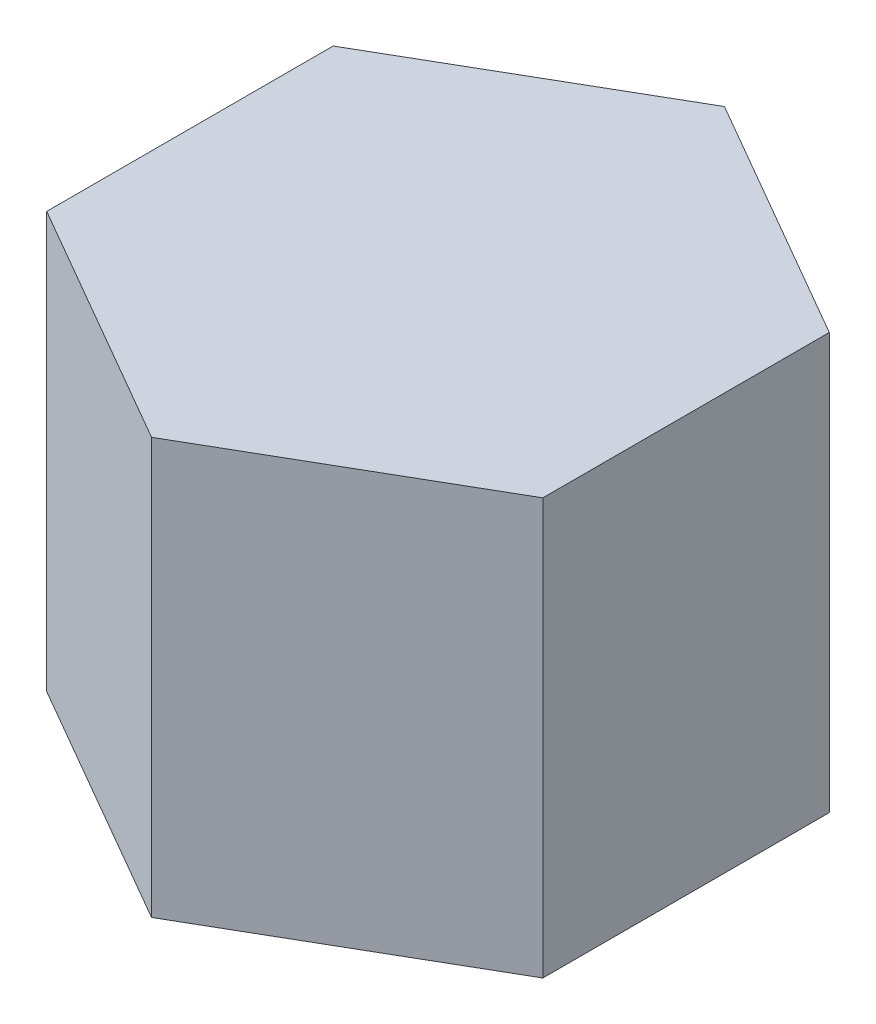
ISO-10303-21;
HEADER;
FILE_DESCRIPTION(('STEP AP214'),'2;1');
FILE_NAME('part.step','',(''),(''),'','','');
FILE_SCHEMA(('AUTOMOTIVE_DESIGN { 1 0 10303 214 1 1 1 1 }'));
ENDSEC;
DATA;
#1=APPLICATION_CONTEXT('core data for automotive mechanical design processes');
#2=APPLICATION_PROTOCOL_DEFINITION('international standard','automotive_design',2000,#1);
#3=PRODUCT_CONTEXT('',#1,'mechanical');
#4=PRODUCT('Part','Part','',(#3));
#5=PRODUCT_RELATED_PRODUCT_CATEGORY('part','',(#4));
#6=PRODUCT_DEFINITION_FORMATION('','',#4);
#7=PRODUCT_DEFINITION_CONTEXT('part definition',#1,'design');
#8=PRODUCT_DEFINITION('design','',#6,#7);
#9=PRODUCT_DEFINITION_SHAPE('','',#8);
#10=(LENGTH_UNIT() NAMED_UNIT(*) SI_UNIT(.MILLI.,.METRE.));
#11=(NAMED_UNIT(*) PLANE_ANGLE_UNIT() SI_UNIT($,.RADIAN.));
#12=(NAMED_UNIT(*) SI_UNIT($,.STERADIAN.) SOLID_ANGLE_UNIT());
#13=UNCERTAINTY_MEASURE_WITH_UNIT(LENGTH_MEASURE(1.E-05),#10,'distance_accuracy_value','');
#14=(GEOMETRIC_REPRESENTATION_CONTEXT(3) GLOBAL_UNCERTAINTY_ASSIGNED_CONTEXT((#13)) GLOBAL_UNIT_ASSIGNED_CONTEXT((#10,
#11,#12)) REPRESENTATION_CONTEXT('',''));
#15=CARTESIAN_POINT('',(0.,0.,0.));
#16=DIRECTION('',(0.,0.,1.));
#17=DIRECTION('',(1.,0.,0.));
#18=AXIS2_PLACEMENT_3D('',#15,#16,#17);
#19=CARTESIAN_POINT('',(208.142660308706,-148.537700895744,288.908895009141));
#20=DIRECTION('',(-0.499999999999943,0.,-0.866025403784472));
#21=DIRECTION('',(-0.866025403784472,0.,0.499999999999943));
#22=AXIS2_PLACEMENT_3D('',#19,#20,#21);
#23=PLANE('',#22);
#24=CARTESIAN_POINT('',(207.839551417382,-149.045793579175,289.083895009141));
#25=DIRECTION('',(0.866025403784471,0.,-0.499999999999943));
#26=VECTOR('',#25,1.);
#27=LINE('',#24,#26);
#28=CARTESIAN_POINT('',(207.839551417382,-149.045793579175,289.083895009141));
#29=VERTEX_POINT('',#28);
#30=CARTESIAN_POINT('',(208.142660308706,-149.045793579175,288.908895009141));
#31=VERTEX_POINT('',#30);
#32=EDGE_CURVE('E170',#29,#31,#27,.T.);
#33=ORIENTED_EDGE('',*,*,#32,.T.);
#34=CARTESIAN_POINT('',(208.142660308706,-148.537700895744,288.908895009141));
#35=DIRECTION('',(0.,-1.,0.));
#36=VECTOR('',#35,1.);
#37=LINE('',#34,#36);
#38=CARTESIAN_POINT('',(208.142660308706,-148.537700895744,288.908895009141));
#39=VERTEX_POINT('',#38);
#40=EDGE_CURVE('E35',#39,#31,#37,.T.);
#41=ORIENTED_EDGE('',*,*,#40,.F.);
#42=CARTESIAN_POINT('',(207.839551417382,-148.537700895744,289.083895009141));
#43=DIRECTION('',(0.866025403784471,0.,-0.499999999999943));
#44=VECTOR('',#43,1.);
#45=LINE('',#42,#44);
#46=CARTESIAN_POINT('',(207.839551417382,-148.537700895744,289.083895009141));
#47=VERTEX_POINT('',#46);
#48=EDGE_CURVE('E159',#47,#39,#45,.T.);
#49=ORIENTED_EDGE('',*,*,#48,.F.);
#50=CARTESIAN_POINT('',(207.839551417382,-148.537700895744,289.083895009141));
#51=DIRECTION('',(0.,-1.,0.));
#52=VECTOR('',#51,1.);
#53=LINE('',#50,#52);
#54=EDGE_CURVE('E10',#47,#29,#53,.T.);
#55=ORIENTED_EDGE('',*,*,#54,.T.);
#56=EDGE_LOOP('',(#33,#41,#49,#55));
#57=FACE_BOUND('',#56,.T.);
#58=ADVANCED_FACE('F16',(#57),#23,.F.);
#59=CARTESIAN_POINT('',(207.839551417382,-148.537700895744,289.083895009141));
#60=DIRECTION('',(0.499999999999978,0.,-0.866025403784452));
#61=DIRECTION('',(-0.866025403784452,0.,-0.499999999999978));
#62=AXIS2_PLACEMENT_3D('',#59,#60,#61);
#63=PLANE('',#62);
#64=CARTESIAN_POINT('',(207.536442526057,-149.045793579175,288.908895009141));
#65=DIRECTION('',(0.866025403784452,0.,0.499999999999978));
#66=VECTOR('',#65,1.);
#67=LINE('',#64,#66);
#68=CARTESIAN_POINT('',(207.536442526057,-149.045793579175,288.908895009141));
#69=VERTEX_POINT('',#68);
#70=EDGE_CURVE('E167',#69,#29,#67,.T.);
#71=ORIENTED_EDGE('',*,*,#70,.T.);
#72=ORIENTED_EDGE('',*,*,#54,.F.);
#73=CARTESIAN_POINT('',(207.536442526057,-148.537700895744,288.908895009141));
#74=DIRECTION('',(0.866025403784452,0.,0.499999999999978));
#75=VECTOR('',#74,1.);
#76=LINE('',#73,#75);
#77=CARTESIAN_POINT('',(207.536442526057,-148.537700895744,288.908895009141));
#78=VERTEX_POINT('',#77);
#79=EDGE_CURVE('E156',#78,#47,#76,.T.);
#80=ORIENTED_EDGE('',*,*,#79,.F.);
#81=CARTESIAN_POINT('',(207.536442526057,-148.537700895744,288.908895009141));
#82=DIRECTION('',(0.,-1.,0.));
#83=VECTOR('',#82,1.);
#84=LINE('',#81,#83);
#85=EDGE_CURVE('E27',#78,#69,#84,.T.);
#86=ORIENTED_EDGE('',*,*,#85,.T.);
#87=EDGE_LOOP('',(#71,#72,#80,#86));
#88=FACE_BOUND('',#87,.T.);
#89=ADVANCED_FACE('F189',(#88),#63,.F.);
#90=CARTESIAN_POINT('',(207.536442526057,-148.537700895744,290.831971220494));
#91=DIRECTION('',(1.,0.,0.));
#92=DIRECTION('',(0.,1.,0.));
#93=AXIS2_PLACEMENT_3D('',#90,#91,#92);
#94=PLANE('',#93);
#95=CARTESIAN_POINT('',(207.536442526057,-149.045793579175,288.558895009141));
#96=DIRECTION('',(0.,0.,1.));
#97=VECTOR('',#96,1.);
#98=LINE('',#95,#97);
#99=CARTESIAN_POINT('',(207.536442526057,-149.045793579175,288.558895009141));
#100=VERTEX_POINT('',#99);
#101=EDGE_CURVE('E163',#100,#69,#98,.T.);
#102=ORIENTED_EDGE('',*,*,#101,.T.);
#103=ORIENTED_EDGE('',*,*,#85,.F.);
#104=CARTESIAN_POINT('',(207.536442526057,-148.537700895744,288.558895009141));
#105=DIRECTION('',(0.,0.,1.));
#106=VECTOR('',#105,1.);
#107=LINE('',#104,#106);
#108=CARTESIAN_POINT('',(207.536442526057,-148.537700895744,288.558895009141));
#109=VERTEX_POINT('',#108);
#110=EDGE_CURVE('E106',#109,#78,#107,.T.);
#111=ORIENTED_EDGE('',*,*,#110,.F.);
#112=CARTESIAN_POINT('',(207.536442526057,-148.537700895744,288.558895009141));
#113=DIRECTION('',(0.,-1.,0.));
#114=VECTOR('',#113,1.);
#115=LINE('',#112,#114);
#116=EDGE_CURVE('E94',#109,#100,#115,.T.);
#117=ORIENTED_EDGE('',*,*,#116,.T.);
#118=EDGE_LOOP('',(#102,#103,#111,#117));
#119=FACE_BOUND('',#118,.T.);
#120=ADVANCED_FACE('F198',(#119),#94,.F.);
#121=CARTESIAN_POINT('',(207.536442526057,-148.537700895744,288.558895009141));
#122=DIRECTION('',(0.499999999999978,0.,0.866025403784452));
#123=DIRECTION('',(0.866025403784452,0.,-0.499999999999978));
#124=AXIS2_PLACEMENT_3D('',#121,#122,#123);
#125=PLANE('',#124);
#126=CARTESIAN_POINT('',(207.839551417382,-149.045793579175,288.383895009141));
#127=DIRECTION('',(-0.866025403784452,0.,0.499999999999978));
#128=VECTOR('',#127,1.);
#129=LINE('',#126,#128);
#130=CARTESIAN_POINT('',(207.839551417382,-149.045793579175,288.383895009141));
#131=VERTEX_POINT('',#130);
#132=EDGE_CURVE('E162',#131,#100,#129,.T.);
#133=ORIENTED_EDGE('',*,*,#132,.T.);
#134=ORIENTED_EDGE('',*,*,#116,.F.);
#135=CARTESIAN_POINT('',(207.839551417382,-148.537700895744,288.383895009141));
#136=DIRECTION('',(-0.866025403784452,0.,0.499999999999978));
#137=VECTOR('',#136,1.);
#138=LINE('',#135,#137);
#139=CARTESIAN_POINT('',(207.839551417382,-148.537700895744,288.383895009141));
#140=VERTEX_POINT('',#139);
#141=EDGE_CURVE('E98',#140,#109,#138,.T.);
#142=ORIENTED_EDGE('',*,*,#141,.F.);
#143=CARTESIAN_POINT('',(207.839551417382,-148.537700895744,288.383895009141));
#144=DIRECTION('',(0.,-1.,0.));
#145=VECTOR('',#144,1.);
#146=LINE('',#143,#145);
#147=EDGE_CURVE('E79',#140,#131,#146,.T.);
#148=ORIENTED_EDGE('',*,*,#147,.T.);
#149=EDGE_LOOP('',(#133,#134,#142,#148));
#150=FACE_BOUND('',#149,.T.);
#151=ADVANCED_FACE('F100',(#150),#125,.F.);
#152=CARTESIAN_POINT('',(207.839551417382,-148.537700895744,288.383895009141));
#153=DIRECTION('',(-0.499999999999943,0.,0.866025403784472));
#154=DIRECTION('',(0.866025403784472,0.,0.499999999999943));
#155=AXIS2_PLACEMENT_3D('',#152,#153,#154);
#156=PLANE('',#155);
#157=CARTESIAN_POINT('',(208.142660308706,-149.045793579175,288.558895009141));
#158=DIRECTION('',(-0.866025403784471,0.,-0.499999999999943));
#159=VECTOR('',#158,1.);
#160=LINE('',#157,#159);
#161=CARTESIAN_POINT('',(208.142660308706,-149.045793579175,288.558895009141));
#162=VERTEX_POINT('',#161);
#163=EDGE_CURVE('E88',#162,#131,#160,.T.);
#164=ORIENTED_EDGE('',*,*,#163,.T.);
#165=ORIENTED_EDGE('',*,*,#147,.F.);
#166=CARTESIAN_POINT('',(208.142660308706,-148.537700895744,288.558895009141));
#167=DIRECTION('',(-0.866025403784471,0.,-0.499999999999943));
#168=VECTOR('',#167,1.);
#169=LINE('',#166,#168);
#170=CARTESIAN_POINT('',(208.142660308706,-148.537700895744,288.558895009141));
#171=VERTEX_POINT('',#170);
#172=EDGE_CURVE('E84',#171,#140,#169,.T.);
#173=ORIENTED_EDGE('',*,*,#172,.F.);
#174=CARTESIAN_POINT('',(208.142660308706,-148.537700895744,288.558895009141));
#175=DIRECTION('',(0.,-1.,0.));
#176=VECTOR('',#175,1.);
#177=LINE('',#174,#176);
#178=EDGE_CURVE('E58',#171,#162,#177,.T.);
#179=ORIENTED_EDGE('',*,*,#178,.T.);
#180=EDGE_LOOP('',(#164,#165,#173,#179));
#181=FACE_BOUND('',#180,.T.);
#182=ADVANCED_FACE('F82',(#181),#156,.F.);
#183=CARTESIAN_POINT('',(208.142660308706,-148.537700895744,290.831971220494));
#184=DIRECTION('',(-1.,0.,0.));
#185=DIRECTION('',(0.,-1.,0.));
#186=AXIS2_PLACEMENT_3D('',#183,#184,#185);
#187=PLANE('',#186);
#188=CARTESIAN_POINT('',(208.142660308706,-149.045793579175,288.908895009141));
#189=DIRECTION('',(0.,0.,-1.));
#190=VECTOR('',#189,1.);
#191=LINE('',#188,#190);
#192=EDGE_CURVE('E160',#31,#162,#191,.T.);
#193=ORIENTED_EDGE('',*,*,#192,.T.);
#194=ORIENTED_EDGE('',*,*,#178,.F.);
#195=CARTESIAN_POINT('',(208.142660308706,-148.537700895744,288.908895009141));
#196=DIRECTION('',(0.,0.,-1.));
#197=VECTOR('',#196,1.);
#198=LINE('',#195,#197);
#199=EDGE_CURVE('E112',#39,#171,#198,.T.);
#200=ORIENTED_EDGE('',*,*,#199,.F.);
#201=ORIENTED_EDGE('',*,*,#40,.T.);
#202=EDGE_LOOP('',(#193,#194,#200,#201));
#203=FACE_BOUND('',#202,.T.);
#204=ADVANCED_FACE('F131',(#203),#187,.F.);
#205=CARTESIAN_POINT('',(206.339551417382,-148.537700895744,290.831971220494));
#206=DIRECTION('',(0.,-1.,0.));
#207=DIRECTION('',(1.,0.,0.));
#208=AXIS2_PLACEMENT_3D('',#205,#206,#207);
#209=PLANE('',#208);
#210=ORIENTED_EDGE('',*,*,#48,.T.);
#211=ORIENTED_EDGE('',*,*,#199,.T.);
#212=ORIENTED_EDGE('',*,*,#172,.T.);
#213=ORIENTED_EDGE('',*,*,#141,.T.);
#214=ORIENTED_EDGE('',*,*,#110,.T.);
#215=ORIENTED_EDGE('',*,*,#79,.T.);
#216=EDGE_LOOP('',(#210,#211,#212,#213,#214,#215));
#217=FACE_BOUND('',#216,.T.);
#218=ADVANCED_FACE('F111',(#217),#209,.F.);
#219=CARTESIAN_POINT('',(206.339551417382,-149.045793579175,290.831971220494));
#220=DIRECTION('',(0.,-1.,0.));
#221=DIRECTION('',(1.,0.,0.));
#222=AXIS2_PLACEMENT_3D('',#219,#220,#221);
#223=PLANE('',#222);
#224=ORIENTED_EDGE('',*,*,#32,.F.);
#225=ORIENTED_EDGE('',*,*,#70,.F.);
#226=ORIENTED_EDGE('',*,*,#101,.F.);
#227=ORIENTED_EDGE('',*,*,#132,.F.);
#228=ORIENTED_EDGE('',*,*,#163,.F.);
#229=ORIENTED_EDGE('',*,*,#192,.F.);
#230=EDGE_LOOP('',(#224,#225,#226,#227,#228,#229));
#231=FACE_BOUND('',#230,.T.);
#232=ADVANCED_FACE('F130',(#231),#223,.T.);
#233=CLOSED_SHELL('',(#58,#89,#120,#151,#182,#204,#218,#232));
#234=MANIFOLD_SOLID_BREP('B1',#233);
#235=ADVANCED_BREP_SHAPE_REPRESENTATION('',(#18,#234),#14);
#236=SHAPE_DEFINITION_REPRESENTATION(#9,#235);
ENDSEC;
END-ISO-10303-21;
